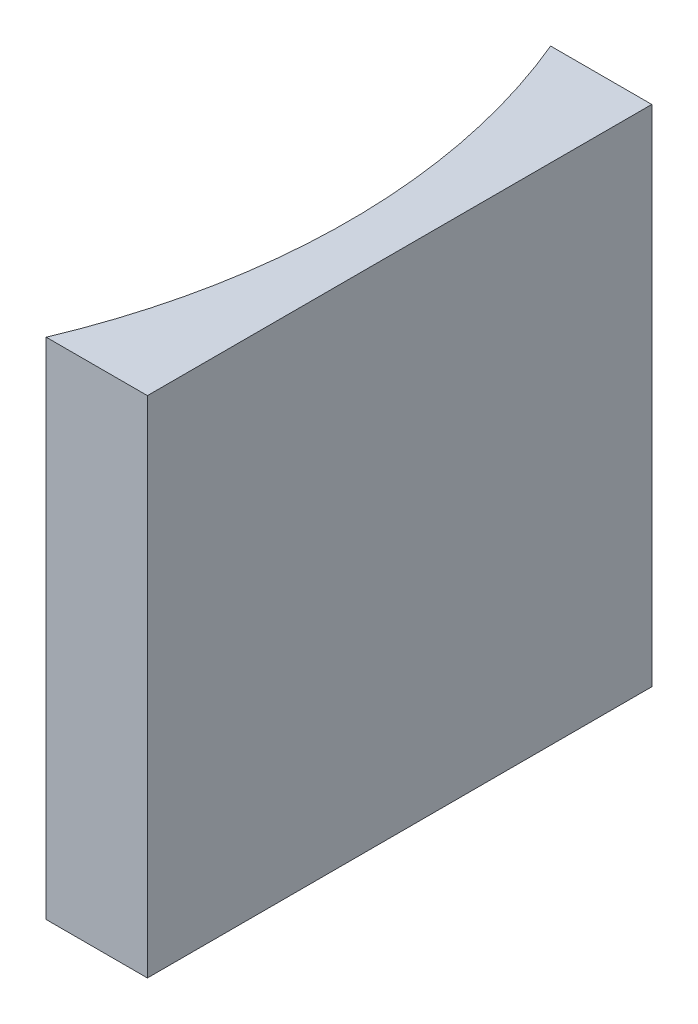
ISO-10303-21;
HEADER;
FILE_DESCRIPTION(('STEP AP214'),'2;1');
FILE_NAME('part.step','',(''),(''),'','','');
FILE_SCHEMA(('AUTOMOTIVE_DESIGN { 1 0 10303 214 1 1 1 1 }'));
ENDSEC;
DATA;
#1=APPLICATION_CONTEXT('core data for automotive mechanical design processes');
#2=APPLICATION_PROTOCOL_DEFINITION('international standard','automotive_design',2000,#1);
#3=PRODUCT_CONTEXT('',#1,'mechanical');
#4=PRODUCT('Part','Part','',(#3));
#5=PRODUCT_RELATED_PRODUCT_CATEGORY('part','',(#4));
#6=PRODUCT_DEFINITION_FORMATION('','',#4);
#7=PRODUCT_DEFINITION_CONTEXT('part definition',#1,'design');
#8=PRODUCT_DEFINITION('design','',#6,#7);
#9=PRODUCT_DEFINITION_SHAPE('','',#8);
#10=(LENGTH_UNIT() NAMED_UNIT(*) SI_UNIT(.MILLI.,.METRE.));
#11=(NAMED_UNIT(*) PLANE_ANGLE_UNIT() SI_UNIT($,.RADIAN.));
#12=(NAMED_UNIT(*) SI_UNIT($,.STERADIAN.) SOLID_ANGLE_UNIT());
#13=UNCERTAINTY_MEASURE_WITH_UNIT(LENGTH_MEASURE(1.E-05),#10,'distance_accuracy_value','');
#14=(GEOMETRIC_REPRESENTATION_CONTEXT(3) GLOBAL_UNCERTAINTY_ASSIGNED_CONTEXT((#13)) GLOBAL_UNIT_ASSIGNED_CONTEXT((#10,
#11,#12)) REPRESENTATION_CONTEXT('',''));
#15=CARTESIAN_POINT('',(0.,0.,0.));
#16=DIRECTION('',(0.,0.,1.));
#17=DIRECTION('',(1.,0.,0.));
#18=AXIS2_PLACEMENT_3D('',#15,#16,#17);
#19=CARTESIAN_POINT('',(0.,20.,0.));
#20=DIRECTION('',(0.,0.,1.));
#21=DIRECTION('',(1.,0.,0.));
#22=AXIS2_PLACEMENT_3D('',#19,#20,#21);
#23=PLANE('',#22);
#24=DIRECTION('',(-1.,0.,0.));
#25=VECTOR('',#24,1.);
#26=CARTESIAN_POINT('',(0.,0.,0.));
#27=LINE('',#26,#25);
#28=CARTESIAN_POINT('',(0.,0.,0.));
#29=VERTEX_POINT('',#28);
#30=CARTESIAN_POINT('',(-4.01258193511721,0.,0.));
#31=VERTEX_POINT('',#30);
#32=EDGE_CURVE('E100',#29,#31,#27,.T.);
#33=ORIENTED_EDGE('',*,*,#32,.T.);
#34=DIRECTION('',(0.,-1.,0.));
#35=VECTOR('',#34,1.);
#36=CARTESIAN_POINT('',(-4.01258193511721,20.,0.));
#37=LINE('',#36,#35);
#38=CARTESIAN_POINT('',(-4.01258193511721,20.,0.));
#39=VERTEX_POINT('',#38);
#40=EDGE_CURVE('E11',#39,#31,#37,.T.);
#41=ORIENTED_EDGE('',*,*,#40,.F.);
#42=DIRECTION('',(-1.,0.,0.));
#43=VECTOR('',#42,1.);
#44=CARTESIAN_POINT('',(0.,20.,0.));
#45=LINE('',#44,#43);
#46=CARTESIAN_POINT('',(0.,20.,0.));
#47=VERTEX_POINT('',#46);
#48=EDGE_CURVE('E88',#47,#39,#45,.T.);
#49=ORIENTED_EDGE('',*,*,#48,.F.);
#50=DIRECTION('',(0.,-1.,0.));
#51=VECTOR('',#50,1.);
#52=CARTESIAN_POINT('',(0.,20.,0.));
#53=LINE('',#52,#51);
#54=EDGE_CURVE('E96',#47,#29,#53,.T.);
#55=ORIENTED_EDGE('',*,*,#54,.T.);
#56=EDGE_LOOP('',(#33,#41,#49,#55));
#57=FACE_BOUND('',#56,.T.);
#58=ADVANCED_FACE('F37',(#57),#23,.F.);
#59=CARTESIAN_POINT('',(-27.85,20.,10.));
#60=DIRECTION('',(0.,-1.,0.));
#61=DIRECTION('',(0.,0.,-1.));
#62=AXIS2_PLACEMENT_3D('',#59,#60,#61);
#63=CYLINDRICAL_SURFACE('',#62,25.85);
#64=CARTESIAN_POINT('',(-27.85,0.,10.));
#65=DIRECTION('',(0.,-1.,0.));
#66=DIRECTION('',(0.,0.,1.));
#67=AXIS2_PLACEMENT_3D('',#64,#65,#66);
#68=CIRCLE('',#67,25.85);
#69=CARTESIAN_POINT('',(-4.01258193511721,0.,20.));
#70=VERTEX_POINT('',#69);
#71=EDGE_CURVE('E92',#31,#70,#68,.T.);
#72=ORIENTED_EDGE('',*,*,#71,.T.);
#73=DIRECTION('',(0.,-1.,0.));
#74=VECTOR('',#73,1.);
#75=CARTESIAN_POINT('',(-4.01258193511721,20.,20.));
#76=LINE('',#75,#74);
#77=CARTESIAN_POINT('',(-4.01258193511721,20.,20.));
#78=VERTEX_POINT('',#77);
#79=EDGE_CURVE('E45',#78,#70,#76,.T.);
#80=ORIENTED_EDGE('',*,*,#79,.F.);
#81=CARTESIAN_POINT('',(-27.85,20.,10.));
#82=DIRECTION('',(0.,-1.,0.));
#83=DIRECTION('',(0.,0.,1.));
#84=AXIS2_PLACEMENT_3D('',#81,#82,#83);
#85=CIRCLE('',#84,25.85);
#86=EDGE_CURVE('E83',#39,#78,#85,.T.);
#87=ORIENTED_EDGE('',*,*,#86,.F.);
#88=ORIENTED_EDGE('',*,*,#40,.T.);
#89=EDGE_LOOP('',(#72,#80,#87,#88));
#90=FACE_BOUND('',#89,.T.);
#91=ADVANCED_FACE('F91',(#90),#63,.F.);
#92=CARTESIAN_POINT('',(0.,20.,20.));
#93=DIRECTION('',(0.,0.,-1.));
#94=DIRECTION('',(-1.,0.,0.));
#95=AXIS2_PLACEMENT_3D('',#92,#93,#94);
#96=PLANE('',#95);
#97=DIRECTION('',(1.,0.,0.));
#98=VECTOR('',#97,1.);
#99=CARTESIAN_POINT('',(0.,0.,20.));
#100=LINE('',#99,#98);
#101=CARTESIAN_POINT('',(0.,0.,20.));
#102=VERTEX_POINT('',#101);
#103=EDGE_CURVE('E70',#70,#102,#100,.T.);
#104=ORIENTED_EDGE('',*,*,#103,.T.);
#105=DIRECTION('',(0.,-1.,0.));
#106=VECTOR('',#105,1.);
#107=CARTESIAN_POINT('',(0.,20.,20.));
#108=LINE('',#107,#106);
#109=CARTESIAN_POINT('',(0.,20.,20.));
#110=VERTEX_POINT('',#109);
#111=EDGE_CURVE('E93',#110,#102,#108,.T.);
#112=ORIENTED_EDGE('',*,*,#111,.F.);
#113=DIRECTION('',(1.,0.,0.));
#114=VECTOR('',#113,1.);
#115=CARTESIAN_POINT('',(0.,20.,20.));
#116=LINE('',#115,#114);
#117=EDGE_CURVE('E86',#78,#110,#116,.T.);
#118=ORIENTED_EDGE('',*,*,#117,.F.);
#119=ORIENTED_EDGE('',*,*,#79,.T.);
#120=EDGE_LOOP('',(#104,#112,#118,#119));
#121=FACE_BOUND('',#120,.T.);
#122=ADVANCED_FACE('F94',(#121),#96,.F.);
#123=CARTESIAN_POINT('',(0.,20.,0.));
#124=DIRECTION('',(-1.,0.,0.));
#125=DIRECTION('',(0.,0.,1.));
#126=AXIS2_PLACEMENT_3D('',#123,#124,#125);
#127=PLANE('',#126);
#128=DIRECTION('',(0.,0.,-1.));
#129=VECTOR('',#128,1.);
#130=CARTESIAN_POINT('',(0.,0.,0.));
#131=LINE('',#130,#129);
#132=EDGE_CURVE('E76',#102,#29,#131,.T.);
#133=ORIENTED_EDGE('',*,*,#132,.T.);
#134=ORIENTED_EDGE('',*,*,#54,.F.);
#135=DIRECTION('',(0.,0.,-1.));
#136=VECTOR('',#135,1.);
#137=CARTESIAN_POINT('',(0.,20.,0.));
#138=LINE('',#137,#136);
#139=EDGE_CURVE('E53',#110,#47,#138,.T.);
#140=ORIENTED_EDGE('',*,*,#139,.F.);
#141=ORIENTED_EDGE('',*,*,#111,.T.);
#142=EDGE_LOOP('',(#133,#134,#140,#141));
#143=FACE_BOUND('',#142,.T.);
#144=ADVANCED_FACE('F107',(#143),#127,.F.);
#145=CARTESIAN_POINT('',(-27.85,20.,10.));
#146=DIRECTION('',(0.,1.,0.));
#147=DIRECTION('',(0.,0.,1.));
#148=AXIS2_PLACEMENT_3D('',#145,#146,#147);
#149=PLANE('',#148);
#150=ORIENTED_EDGE('',*,*,#48,.T.);
#151=ORIENTED_EDGE('',*,*,#86,.T.);
#152=ORIENTED_EDGE('',*,*,#117,.T.);
#153=ORIENTED_EDGE('',*,*,#139,.T.);
#154=EDGE_LOOP('',(#150,#151,#152,#153));
#155=FACE_BOUND('',#154,.T.);
#156=ADVANCED_FACE('F84',(#155),#149,.T.);
#157=CARTESIAN_POINT('',(-27.85,0.,10.));
#158=DIRECTION('',(0.,1.,0.));
#159=DIRECTION('',(0.,0.,1.));
#160=AXIS2_PLACEMENT_3D('',#157,#158,#159);
#161=PLANE('',#160);
#162=ORIENTED_EDGE('',*,*,#32,.F.);
#163=ORIENTED_EDGE('',*,*,#132,.F.);
#164=ORIENTED_EDGE('',*,*,#103,.F.);
#165=ORIENTED_EDGE('',*,*,#71,.F.);
#166=EDGE_LOOP('',(#162,#163,#164,#165));
#167=FACE_BOUND('',#166,.T.);
#168=ADVANCED_FACE('F110',(#167),#161,.F.);
#169=CLOSED_SHELL('',(#58,#91,#122,#144,#156,#168));
#170=MANIFOLD_SOLID_BREP('B2',#169);
#171=ADVANCED_BREP_SHAPE_REPRESENTATION('',(#18,#170),#14);
#172=SHAPE_DEFINITION_REPRESENTATION(#9,#171);
ENDSEC;
END-ISO-10303-21;
